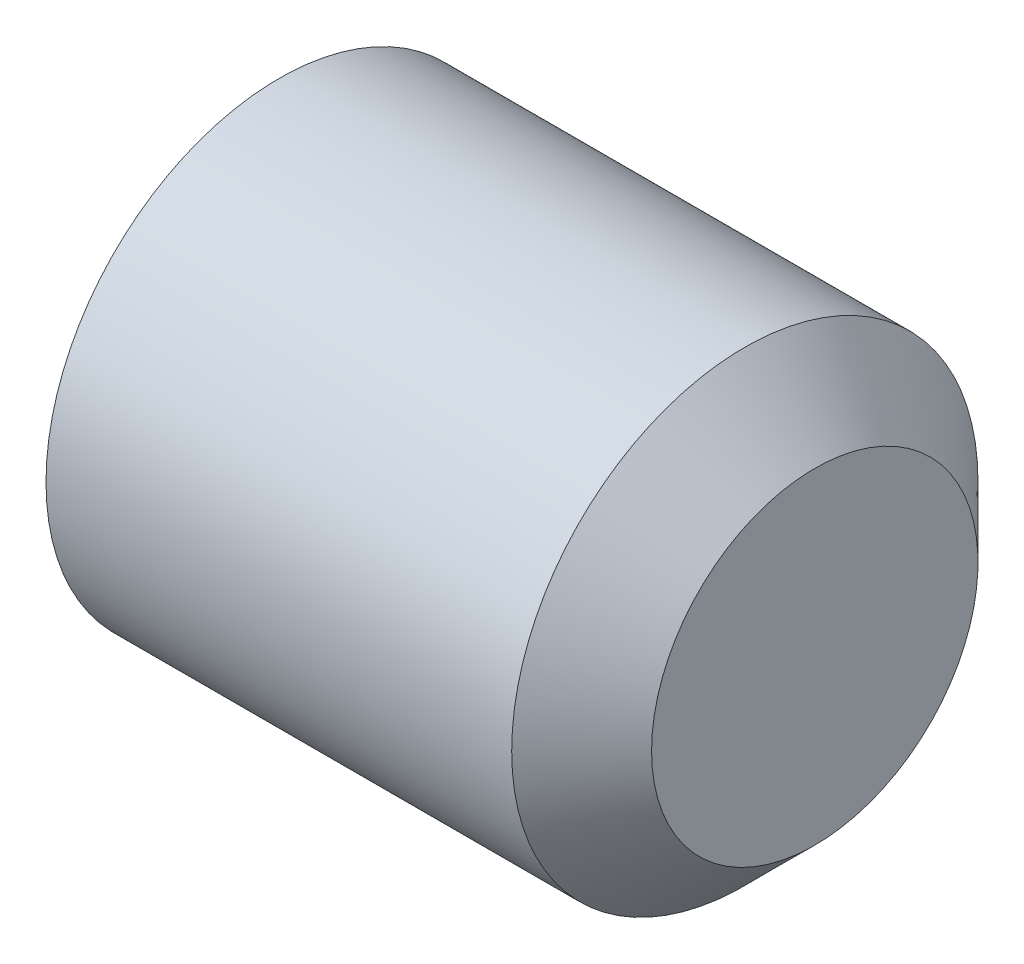
ISO-10303-21;
HEADER;
FILE_DESCRIPTION(('STEP AP214'),'2;1');
FILE_NAME('part.step','',(''),(''),'','','');
FILE_SCHEMA(('AUTOMOTIVE_DESIGN { 1 0 10303 214 1 1 1 1 }'));
ENDSEC;
DATA;
#1=APPLICATION_CONTEXT('core data for automotive mechanical design processes');
#2=APPLICATION_PROTOCOL_DEFINITION('international standard','automotive_design',2000,#1);
#3=PRODUCT_CONTEXT('',#1,'mechanical');
#4=PRODUCT('Part','Part','',(#3));
#5=PRODUCT_RELATED_PRODUCT_CATEGORY('part','',(#4));
#6=PRODUCT_DEFINITION_FORMATION('','',#4);
#7=PRODUCT_DEFINITION_CONTEXT('part definition',#1,'design');
#8=PRODUCT_DEFINITION('design','',#6,#7);
#9=PRODUCT_DEFINITION_SHAPE('','',#8);
#10=(LENGTH_UNIT() NAMED_UNIT(*) SI_UNIT(.MILLI.,.METRE.));
#11=(NAMED_UNIT(*) PLANE_ANGLE_UNIT() SI_UNIT($,.RADIAN.));
#12=(NAMED_UNIT(*) SI_UNIT($,.STERADIAN.) SOLID_ANGLE_UNIT());
#13=UNCERTAINTY_MEASURE_WITH_UNIT(LENGTH_MEASURE(1.E-05),#10,'distance_accuracy_value','');
#14=(GEOMETRIC_REPRESENTATION_CONTEXT(3) GLOBAL_UNCERTAINTY_ASSIGNED_CONTEXT((#13)) GLOBAL_UNIT_ASSIGNED_CONTEXT((#10,
#11,#12)) REPRESENTATION_CONTEXT('',''));
#15=CARTESIAN_POINT('',(0.,0.,0.));
#16=DIRECTION('',(0.,0.,1.));
#17=DIRECTION('',(1.,0.,0.));
#18=AXIS2_PLACEMENT_3D('',#15,#16,#17);
#19=CARTESIAN_POINT('',(0.,0.,0.));
#20=DIRECTION('',(-1.,0.,0.));
#21=DIRECTION('',(0.,0.,1.));
#22=AXIS2_PLACEMENT_3D('',#19,#20,#21);
#23=PLANE('',#22);
#24=CARTESIAN_POINT('',(0.,0.,0.));
#25=DIRECTION('',(-1.,0.,0.));
#26=DIRECTION('',(0.,0.,1.));
#27=AXIS2_PLACEMENT_3D('',#24,#25,#26);
#28=CIRCLE('',#27,2.055);
#29=CARTESIAN_POINT('',(0.,0.,2.055));
#30=VERTEX_POINT('',#29);
#31=EDGE_CURVE('E119',#30,#30,#28,.T.);
#32=ORIENTED_EDGE('',*,*,#31,.T.);
#33=EDGE_LOOP('',(#32));
#34=FACE_BOUND('',#33,.T.);
#35=DIRECTION('',(0.,0.,-1.));
#36=VECTOR('',#35,1.);
#37=CARTESIAN_POINT('',(0.,1.25,0.721687836487029));
#38=LINE('',#37,#36);
#39=CARTESIAN_POINT('',(0.,1.25,0.721687836487029));
#40=VERTEX_POINT('',#39);
#41=CARTESIAN_POINT('',(0.,1.25,-0.721687836487036));
#42=VERTEX_POINT('',#41);
#43=EDGE_CURVE('E110',#40,#42,#38,.T.);
#44=ORIENTED_EDGE('',*,*,#43,.F.);
#45=DIRECTION('',(0.,-0.866025403784439,0.5));
#46=VECTOR('',#45,1.);
#47=CARTESIAN_POINT('',(0.,1.25,0.721687836487029));
#48=LINE('',#47,#46);
#49=CARTESIAN_POINT('',(0.,0.,1.44337567297406));
#50=VERTEX_POINT('',#49);
#51=EDGE_CURVE('E32',#40,#50,#48,.T.);
#52=ORIENTED_EDGE('',*,*,#51,.T.);
#53=DIRECTION('',(0.,0.866025403784439,0.5));
#54=VECTOR('',#53,1.);
#55=CARTESIAN_POINT('',(0.,-1.25,0.721687836487029));
#56=LINE('',#55,#54);
#57=CARTESIAN_POINT('',(0.,-1.25,0.721687836487029));
#58=VERTEX_POINT('',#57);
#59=EDGE_CURVE('E101',#58,#50,#56,.T.);
#60=ORIENTED_EDGE('',*,*,#59,.F.);
#61=DIRECTION('',(0.,0.,-1.));
#62=VECTOR('',#61,1.);
#63=CARTESIAN_POINT('',(0.,-1.25,0.721687836487029));
#64=LINE('',#63,#62);
#65=CARTESIAN_POINT('',(0.,-1.25,-0.721687836487036));
#66=VERTEX_POINT('',#65);
#67=EDGE_CURVE('E104',#58,#66,#64,.T.);
#68=ORIENTED_EDGE('',*,*,#67,.T.);
#69=DIRECTION('',(0.,0.866025403784439,-0.5));
#70=VECTOR('',#69,1.);
#71=CARTESIAN_POINT('',(0.,-1.25,-0.721687836487036));
#72=LINE('',#71,#70);
#73=CARTESIAN_POINT('',(0.,0.,-1.44337567297407));
#74=VERTEX_POINT('',#73);
#75=EDGE_CURVE('E107',#66,#74,#72,.T.);
#76=ORIENTED_EDGE('',*,*,#75,.T.);
#77=DIRECTION('',(0.,-0.866025403784439,-0.5));
#78=VECTOR('',#77,1.);
#79=CARTESIAN_POINT('',(0.,1.25,-0.721687836487036));
#80=LINE('',#79,#78);
#81=EDGE_CURVE('E90',#42,#74,#80,.T.);
#82=ORIENTED_EDGE('',*,*,#81,.F.);
#83=EDGE_LOOP('',(#44,#52,#60,#68,#76,#82));
#84=FACE_BOUND('',#83,.T.);
#85=ADVANCED_FACE('F17',(#34,#84),#23,.T.);
#86=CARTESIAN_POINT('',(6.,1.75,0.));
#87=DIRECTION('',(1.,0.,0.));
#88=DIRECTION('',(0.,0.,-1.));
#89=AXIS2_PLACEMENT_3D('',#86,#87,#88);
#90=PLANE('',#89);
#91=CARTESIAN_POINT('',(6.,0.,0.));
#92=DIRECTION('',(-1.,0.,0.));
#93=DIRECTION('',(0.,0.,1.));
#94=AXIS2_PLACEMENT_3D('',#91,#92,#93);
#95=CIRCLE('',#94,1.75);
#96=CARTESIAN_POINT('',(6.,0.,1.75));
#97=VERTEX_POINT('',#96);
#98=EDGE_CURVE('E11',#97,#97,#95,.T.);
#99=ORIENTED_EDGE('',*,*,#98,.F.);
#100=EDGE_LOOP('',(#99));
#101=FACE_BOUND('',#100,.T.);
#102=ADVANCED_FACE('F19',(#101),#90,.T.);
#103=CARTESIAN_POINT('',(5.25,0.,0.));
#104=DIRECTION('',(-1.,0.,0.));
#105=DIRECTION('',(0.,0.,1.));
#106=AXIS2_PLACEMENT_3D('',#103,#104,#105);
#107=CONICAL_SURFACE('',#106,2.5,0.78539816339745);
#108=ORIENTED_EDGE('',*,*,#98,.T.);
#109=EDGE_LOOP('',(#108));
#110=FACE_BOUND('',#109,.T.);
#111=CARTESIAN_POINT('',(5.25,0.,0.));
#112=DIRECTION('',(-1.,0.,0.));
#113=DIRECTION('',(0.,0.,1.));
#114=AXIS2_PLACEMENT_3D('',#111,#112,#113);
#115=CIRCLE('',#114,2.5);
#116=CARTESIAN_POINT('',(5.25,0.,2.5));
#117=VERTEX_POINT('',#116);
#118=EDGE_CURVE('E25',#117,#117,#115,.T.);
#119=ORIENTED_EDGE('',*,*,#118,.F.);
#120=EDGE_LOOP('',(#119));
#121=FACE_BOUND('',#120,.T.);
#122=ADVANCED_FACE('F130',(#110,#121),#107,.T.);
#123=CARTESIAN_POINT('',(-12.7,0.,0.));
#124=DIRECTION('',(-1.,0.,0.));
#125=DIRECTION('',(0.,0.,1.));
#126=AXIS2_PLACEMENT_3D('',#123,#124,#125);
#127=CYLINDRICAL_SURFACE('',#126,2.5);
#128=ORIENTED_EDGE('',*,*,#118,.T.);
#129=EDGE_LOOP('',(#128));
#130=FACE_BOUND('',#129,.T.);
#131=CARTESIAN_POINT('',(0.256920869789382,0.,0.));
#132=DIRECTION('',(-1.,0.,0.));
#133=DIRECTION('',(0.,0.,1.));
#134=AXIS2_PLACEMENT_3D('',#131,#132,#133);
#135=CIRCLE('',#134,2.5);
#136=CARTESIAN_POINT('',(0.256920869789382,0.,2.5));
#137=VERTEX_POINT('',#136);
#138=EDGE_CURVE('E122',#137,#137,#135,.T.);
#139=ORIENTED_EDGE('',*,*,#138,.F.);
#140=EDGE_LOOP('',(#139));
#141=FACE_BOUND('',#140,.T.);
#142=ADVANCED_FACE('F127',(#130,#141),#127,.T.);
#143=CARTESIAN_POINT('',(0.,0.,0.));
#144=DIRECTION('',(1.,0.,0.));
#145=DIRECTION('',(0.,0.,-1.));
#146=AXIS2_PLACEMENT_3D('',#143,#144,#145);
#147=CONICAL_SURFACE('',#146,2.055,1.0471975511966);
#148=ORIENTED_EDGE('',*,*,#138,.T.);
#149=EDGE_LOOP('',(#148));
#150=FACE_BOUND('',#149,.T.);
#151=ORIENTED_EDGE('',*,*,#31,.F.);
#152=EDGE_LOOP('',(#151));
#153=FACE_BOUND('',#152,.T.);
#154=ADVANCED_FACE('F139',(#150,#153),#147,.T.);
#155=CARTESIAN_POINT('',(3.,1.25,0.721687836487029));
#156=DIRECTION('',(0.,-0.5,-0.866025403784438));
#157=DIRECTION('',(0.,0.866025403784439,-0.5));
#158=AXIS2_PLACEMENT_3D('',#155,#156,#157);
#159=PLANE('',#158);
#160=ORIENTED_EDGE('',*,*,#51,.F.);
#161=DIRECTION('',(-1.,0.,0.));
#162=VECTOR('',#161,1.);
#163=CARTESIAN_POINT('',(3.,1.25,0.721687836487029));
#164=LINE('',#163,#162);
#165=CARTESIAN_POINT('',(3.,1.25,0.721687836487029));
#166=VERTEX_POINT('',#165);
#167=EDGE_CURVE('E37',#166,#40,#164,.T.);
#168=ORIENTED_EDGE('',*,*,#167,.F.);
#169=DIRECTION('',(0.,-0.866025403784439,0.5));
#170=VECTOR('',#169,1.);
#171=CARTESIAN_POINT('',(3.,1.25,0.721687836487029));
#172=LINE('',#171,#170);
#173=CARTESIAN_POINT('',(3.,0.,1.44337567297406));
#174=VERTEX_POINT('',#173);
#175=EDGE_CURVE('E64',#166,#174,#172,.T.);
#176=ORIENTED_EDGE('',*,*,#175,.T.);
#177=DIRECTION('',(-1.,0.,0.));
#178=VECTOR('',#177,1.);
#179=CARTESIAN_POINT('',(3.,0.,1.44337567297406));
#180=LINE('',#179,#178);
#181=EDGE_CURVE('E117',#174,#50,#180,.T.);
#182=ORIENTED_EDGE('',*,*,#181,.T.);
#183=EDGE_LOOP('',(#160,#168,#176,#182));
#184=FACE_BOUND('',#183,.T.);
#185=ADVANCED_FACE('F151',(#184),#159,.T.);
#186=CARTESIAN_POINT('',(3.,-1.25,0.721687836487029));
#187=DIRECTION('',(0.,-0.5,0.866025403784439));
#188=DIRECTION('',(0.,-0.866025403784439,-0.5));
#189=AXIS2_PLACEMENT_3D('',#186,#187,#188);
#190=PLANE('',#189);
#191=ORIENTED_EDGE('',*,*,#59,.T.);
#192=ORIENTED_EDGE('',*,*,#181,.F.);
#193=DIRECTION('',(0.,0.866025403784439,0.5));
#194=VECTOR('',#193,1.);
#195=CARTESIAN_POINT('',(3.,-1.25,0.721687836487029));
#196=LINE('',#195,#194);
#197=CARTESIAN_POINT('',(3.,-1.25,0.721687836487029));
#198=VERTEX_POINT('',#197);
#199=EDGE_CURVE('E254',#198,#174,#196,.T.);
#200=ORIENTED_EDGE('',*,*,#199,.F.);
#201=DIRECTION('',(-1.,0.,0.));
#202=VECTOR('',#201,1.);
#203=CARTESIAN_POINT('',(3.,-1.25,0.721687836487029));
#204=LINE('',#203,#202);
#205=EDGE_CURVE('E115',#198,#58,#204,.T.);
#206=ORIENTED_EDGE('',*,*,#205,.T.);
#207=EDGE_LOOP('',(#191,#192,#200,#206));
#208=FACE_BOUND('',#207,.T.);
#209=ADVANCED_FACE('F159',(#208),#190,.F.);
#210=CARTESIAN_POINT('',(3.,-1.25,0.721687836487029));
#211=DIRECTION('',(0.,1.,0.));
#212=DIRECTION('',(0.,0.,1.));
#213=AXIS2_PLACEMENT_3D('',#210,#211,#212);
#214=PLANE('',#213);
#215=ORIENTED_EDGE('',*,*,#67,.F.);
#216=ORIENTED_EDGE('',*,*,#205,.F.);
#217=DIRECTION('',(0.,0.,-1.));
#218=VECTOR('',#217,1.);
#219=CARTESIAN_POINT('',(3.,-1.25,0.721687836487029));
#220=LINE('',#219,#218);
#221=CARTESIAN_POINT('',(3.,-1.25,-0.721687836487036));
#222=VERTEX_POINT('',#221);
#223=EDGE_CURVE('E85',#198,#222,#220,.T.);
#224=ORIENTED_EDGE('',*,*,#223,.T.);
#225=DIRECTION('',(-1.,0.,0.));
#226=VECTOR('',#225,1.);
#227=CARTESIAN_POINT('',(3.,-1.25,-0.721687836487036));
#228=LINE('',#227,#226);
#229=EDGE_CURVE('E80',#222,#66,#228,.T.);
#230=ORIENTED_EDGE('',*,*,#229,.T.);
#231=EDGE_LOOP('',(#215,#216,#224,#230));
#232=FACE_BOUND('',#231,.T.);
#233=ADVANCED_FACE('F167',(#232),#214,.T.);
#234=CARTESIAN_POINT('',(3.,-1.25,-0.721687836487036));
#235=DIRECTION('',(0.,0.5,0.866025403784439));
#236=DIRECTION('',(0.,-0.866025403784439,0.5));
#237=AXIS2_PLACEMENT_3D('',#234,#235,#236);
#238=PLANE('',#237);
#239=ORIENTED_EDGE('',*,*,#75,.F.);
#240=ORIENTED_EDGE('',*,*,#229,.F.);
#241=DIRECTION('',(0.,0.866025403784439,-0.5));
#242=VECTOR('',#241,1.);
#243=CARTESIAN_POINT('',(3.,-1.25,-0.721687836487036));
#244=LINE('',#243,#242);
#245=CARTESIAN_POINT('',(3.,0.,-1.44337567297407));
#246=VERTEX_POINT('',#245);
#247=EDGE_CURVE('E75',#222,#246,#244,.T.);
#248=ORIENTED_EDGE('',*,*,#247,.T.);
#249=DIRECTION('',(-1.,0.,0.));
#250=VECTOR('',#249,1.);
#251=CARTESIAN_POINT('',(3.,0.,-1.44337567297407));
#252=LINE('',#251,#250);
#253=EDGE_CURVE('E79',#246,#74,#252,.T.);
#254=ORIENTED_EDGE('',*,*,#253,.T.);
#255=EDGE_LOOP('',(#239,#240,#248,#254));
#256=FACE_BOUND('',#255,.T.);
#257=ADVANCED_FACE('F78',(#256),#238,.T.);
#258=CARTESIAN_POINT('',(3.,1.25,-0.721687836487036));
#259=DIRECTION('',(0.,0.5,-0.866025403784439));
#260=DIRECTION('',(0.,0.866025403784439,0.5));
#261=AXIS2_PLACEMENT_3D('',#258,#259,#260);
#262=PLANE('',#261);
#263=ORIENTED_EDGE('',*,*,#81,.T.);
#264=ORIENTED_EDGE('',*,*,#253,.F.);
#265=DIRECTION('',(0.,-0.866025403784439,-0.5));
#266=VECTOR('',#265,1.);
#267=CARTESIAN_POINT('',(3.,1.25,-0.721687836487036));
#268=LINE('',#267,#266);
#269=CARTESIAN_POINT('',(3.,1.25,-0.721687836487036));
#270=VERTEX_POINT('',#269);
#271=EDGE_CURVE('E84',#270,#246,#268,.T.);
#272=ORIENTED_EDGE('',*,*,#271,.F.);
#273=DIRECTION('',(-1.,0.,0.));
#274=VECTOR('',#273,1.);
#275=CARTESIAN_POINT('',(3.,1.25,-0.721687836487036));
#276=LINE('',#275,#274);
#277=EDGE_CURVE('E60',#270,#42,#276,.T.);
#278=ORIENTED_EDGE('',*,*,#277,.T.);
#279=EDGE_LOOP('',(#263,#264,#272,#278));
#280=FACE_BOUND('',#279,.T.);
#281=ADVANCED_FACE('F87',(#280),#262,.F.);
#282=CARTESIAN_POINT('',(3.,1.25,0.721687836487029));
#283=DIRECTION('',(0.,1.,0.));
#284=DIRECTION('',(0.,0.,1.));
#285=AXIS2_PLACEMENT_3D('',#282,#283,#284);
#286=PLANE('',#285);
#287=ORIENTED_EDGE('',*,*,#43,.T.);
#288=ORIENTED_EDGE('',*,*,#277,.F.);
#289=DIRECTION('',(0.,0.,-1.));
#290=VECTOR('',#289,1.);
#291=CARTESIAN_POINT('',(3.,1.25,0.721687836487029));
#292=LINE('',#291,#290);
#293=EDGE_CURVE('E95',#166,#270,#292,.T.);
#294=ORIENTED_EDGE('',*,*,#293,.F.);
#295=ORIENTED_EDGE('',*,*,#167,.T.);
#296=EDGE_LOOP('',(#287,#288,#294,#295));
#297=FACE_BOUND('',#296,.T.);
#298=ADVANCED_FACE('F180',(#297),#286,.F.);
#299=CARTESIAN_POINT('',(3.,2.5,0.));
#300=DIRECTION('',(1.,0.,0.));
#301=DIRECTION('',(0.,0.,-1.));
#302=AXIS2_PLACEMENT_3D('',#299,#300,#301);
#303=PLANE('',#302);
#304=ORIENTED_EDGE('',*,*,#175,.F.);
#305=ORIENTED_EDGE('',*,*,#293,.T.);
#306=ORIENTED_EDGE('',*,*,#271,.T.);
#307=ORIENTED_EDGE('',*,*,#247,.F.);
#308=ORIENTED_EDGE('',*,*,#223,.F.);
#309=ORIENTED_EDGE('',*,*,#199,.T.);
#310=EDGE_LOOP('',(#304,#305,#306,#307,#308,#309));
#311=FACE_BOUND('',#310,.T.);
#312=ADVANCED_FACE('F93',(#311),#303,.F.);
#313=CLOSED_SHELL('',(#85,#102,#122,#142,#154,#185,#209,#233,#257,#281,#298,#312));
#314=MANIFOLD_SOLID_BREP('B1',#313);
#315=ADVANCED_BREP_SHAPE_REPRESENTATION('',(#18,#314),#14);
#316=SHAPE_DEFINITION_REPRESENTATION(#9,#315);
ENDSEC;
END-ISO-10303-21;
